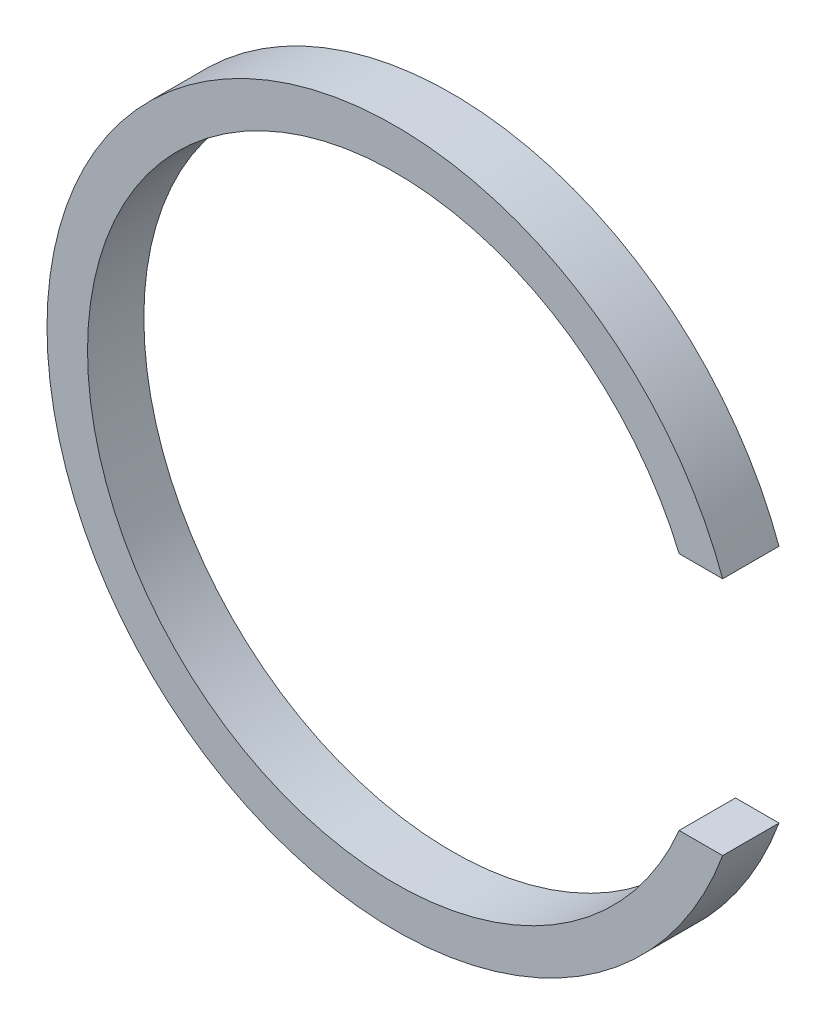
ISO-10303-21;
HEADER;
FILE_DESCRIPTION(('STEP AP214'),'2;1');
FILE_NAME('part.step','',(''),(''),'','','');
FILE_SCHEMA(('AUTOMOTIVE_DESIGN { 1 0 10303 214 1 1 1 1 }'));
ENDSEC;
DATA;
#1=APPLICATION_CONTEXT('core data for automotive mechanical design processes');
#2=APPLICATION_PROTOCOL_DEFINITION('international standard','automotive_design',2000,#1);
#3=PRODUCT_CONTEXT('',#1,'mechanical');
#4=PRODUCT('Part','Part','',(#3));
#5=PRODUCT_RELATED_PRODUCT_CATEGORY('part','',(#4));
#6=PRODUCT_DEFINITION_FORMATION('','',#4);
#7=PRODUCT_DEFINITION_CONTEXT('part definition',#1,'design');
#8=PRODUCT_DEFINITION('design','',#6,#7);
#9=PRODUCT_DEFINITION_SHAPE('','',#8);
#10=(LENGTH_UNIT() NAMED_UNIT(*) SI_UNIT(.MILLI.,.METRE.));
#11=(NAMED_UNIT(*) PLANE_ANGLE_UNIT() SI_UNIT($,.RADIAN.));
#12=(NAMED_UNIT(*) SI_UNIT($,.STERADIAN.) SOLID_ANGLE_UNIT());
#13=UNCERTAINTY_MEASURE_WITH_UNIT(LENGTH_MEASURE(1.E-05),#10,'distance_accuracy_value','');
#14=(GEOMETRIC_REPRESENTATION_CONTEXT(3) GLOBAL_UNCERTAINTY_ASSIGNED_CONTEXT((#13)) GLOBAL_UNIT_ASSIGNED_CONTEXT((#10,
#11,#12)) REPRESENTATION_CONTEXT('',''));
#15=CARTESIAN_POINT('',(0.,0.,0.));
#16=DIRECTION('',(0.,0.,1.));
#17=DIRECTION('',(1.,0.,0.));
#18=AXIS2_PLACEMENT_3D('',#15,#16,#17);
#19=CARTESIAN_POINT('',(70.009432937654,29.574977595057,13.9));
#20=DIRECTION('',(0.,1.,0.));
#21=DIRECTION('',(0.,0.,1.));
#22=AXIS2_PLACEMENT_3D('',#19,#20,#21);
#23=PLANE('',#22);
#24=DIRECTION('',(1.,0.,0.));
#25=VECTOR('',#24,1.);
#26=CARTESIAN_POINT('',(70.009432937654,29.574977595057,0.));
#27=LINE('',#26,#25);
#28=CARTESIAN_POINT('',(70.009432937654,29.574977595057,0.));
#29=VERTEX_POINT('',#28);
#30=CARTESIAN_POINT('',(80.7546946019355,29.574977595057,0.));
#31=VERTEX_POINT('',#30);
#32=EDGE_CURVE('E98',#29,#31,#27,.T.);
#33=ORIENTED_EDGE('',*,*,#32,.T.);
#34=DIRECTION('',(0.,0.,-1.));
#35=VECTOR('',#34,1.);
#36=CARTESIAN_POINT('',(80.7546946019355,29.574977595057,13.9));
#37=LINE('',#36,#35);
#38=CARTESIAN_POINT('',(80.7546946019355,29.574977595057,13.9));
#39=VERTEX_POINT('',#38);
#40=EDGE_CURVE('E11',#39,#31,#37,.T.);
#41=ORIENTED_EDGE('',*,*,#40,.F.);
#42=DIRECTION('',(1.,0.,0.));
#43=VECTOR('',#42,1.);
#44=CARTESIAN_POINT('',(70.009432937654,29.574977595057,13.9));
#45=LINE('',#44,#43);
#46=CARTESIAN_POINT('',(70.009432937654,29.574977595057,13.9));
#47=VERTEX_POINT('',#46);
#48=EDGE_CURVE('E84',#47,#39,#45,.T.);
#49=ORIENTED_EDGE('',*,*,#48,.F.);
#50=DIRECTION('',(0.,0.,-1.));
#51=VECTOR('',#50,1.);
#52=CARTESIAN_POINT('',(70.009432937654,29.574977595057,13.9));
#53=LINE('',#52,#51);
#54=EDGE_CURVE('E51',#47,#29,#53,.T.);
#55=ORIENTED_EDGE('',*,*,#54,.T.);
#56=EDGE_LOOP('',(#33,#41,#49,#55));
#57=FACE_BOUND('',#56,.T.);
#58=ADVANCED_FACE('F35',(#57),#23,.F.);
#59=CARTESIAN_POINT('',(0.,0.,13.9));
#60=DIRECTION('',(0.,0.,-1.));
#61=DIRECTION('',(-1.,0.,0.));
#62=AXIS2_PLACEMENT_3D('',#59,#60,#61);
#63=CYLINDRICAL_SURFACE('',#62,86.);
#64=CARTESIAN_POINT('',(0.,0.,0.));
#65=DIRECTION('',(0.,0.,1.));
#66=DIRECTION('',(1.,0.,0.));
#67=AXIS2_PLACEMENT_3D('',#64,#65,#66);
#68=CIRCLE('',#67,86.);
#69=CARTESIAN_POINT('',(80.7546578611195,-29.5750779159334,0.));
#70=VERTEX_POINT('',#69);
#71=EDGE_CURVE('E89',#31,#70,#68,.T.);
#72=ORIENTED_EDGE('',*,*,#71,.T.);
#73=DIRECTION('',(0.,0.,-1.));
#74=VECTOR('',#73,1.);
#75=CARTESIAN_POINT('',(80.7546578611195,-29.5750779159334,13.9));
#76=LINE('',#75,#74);
#77=CARTESIAN_POINT('',(80.7546578611195,-29.5750779159334,13.9));
#78=VERTEX_POINT('',#77);
#79=EDGE_CURVE('E43',#78,#70,#76,.T.);
#80=ORIENTED_EDGE('',*,*,#79,.F.);
#81=CARTESIAN_POINT('',(0.,0.,13.9));
#82=DIRECTION('',(0.,0.,1.));
#83=DIRECTION('',(1.,0.,0.));
#84=AXIS2_PLACEMENT_3D('',#81,#82,#83);
#85=CIRCLE('',#84,86.);
#86=EDGE_CURVE('E76',#39,#78,#85,.T.);
#87=ORIENTED_EDGE('',*,*,#86,.F.);
#88=ORIENTED_EDGE('',*,*,#40,.T.);
#89=EDGE_LOOP('',(#72,#80,#87,#88));
#90=FACE_BOUND('',#89,.T.);
#91=ADVANCED_FACE('F88',(#90),#63,.T.);
#92=CARTESIAN_POINT('',(70.0093905577421,-29.5750779159334,13.9));
#93=DIRECTION('',(0.,1.,0.));
#94=DIRECTION('',(0.,0.,1.));
#95=AXIS2_PLACEMENT_3D('',#92,#93,#94);
#96=PLANE('',#95);
#97=DIRECTION('',(1.,0.,0.));
#98=VECTOR('',#97,1.);
#99=CARTESIAN_POINT('',(70.0093905577421,-29.5750779159334,0.));
#100=LINE('',#99,#98);
#101=CARTESIAN_POINT('',(70.0093905577421,-29.5750779159334,0.));
#102=VERTEX_POINT('',#101);
#103=EDGE_CURVE('E101',#102,#70,#100,.T.);
#104=ORIENTED_EDGE('',*,*,#103,.F.);
#105=DIRECTION('',(0.,0.,-1.));
#106=VECTOR('',#105,1.);
#107=CARTESIAN_POINT('',(70.0093905577421,-29.5750779159334,13.9));
#108=LINE('',#107,#106);
#109=CARTESIAN_POINT('',(70.0093905577421,-29.5750779159334,13.9));
#110=VERTEX_POINT('',#109);
#111=EDGE_CURVE('E65',#110,#102,#108,.T.);
#112=ORIENTED_EDGE('',*,*,#111,.F.);
#113=DIRECTION('',(1.,0.,0.));
#114=VECTOR('',#113,1.);
#115=CARTESIAN_POINT('',(70.0093905577421,-29.5750779159334,13.9));
#116=LINE('',#115,#114);
#117=EDGE_CURVE('E83',#110,#78,#116,.T.);
#118=ORIENTED_EDGE('',*,*,#117,.T.);
#119=ORIENTED_EDGE('',*,*,#79,.T.);
#120=EDGE_LOOP('',(#104,#112,#118,#119));
#121=FACE_BOUND('',#120,.T.);
#122=ADVANCED_FACE('F92',(#121),#96,.T.);
#123=CARTESIAN_POINT('',(0.,0.,13.9));
#124=DIRECTION('',(0.,0.,-1.));
#125=DIRECTION('',(-1.,0.,0.));
#126=AXIS2_PLACEMENT_3D('',#123,#124,#125);
#127=CYLINDRICAL_SURFACE('',#126,76.);
#128=CARTESIAN_POINT('',(0.,0.,0.));
#129=DIRECTION('',(0.,0.,1.));
#130=DIRECTION('',(1.,0.,0.));
#131=AXIS2_PLACEMENT_3D('',#128,#129,#130);
#132=CIRCLE('',#131,76.);
#133=EDGE_CURVE('E103',#29,#102,#132,.T.);
#134=ORIENTED_EDGE('',*,*,#133,.F.);
#135=ORIENTED_EDGE('',*,*,#54,.F.);
#136=CARTESIAN_POINT('',(0.,0.,13.9));
#137=DIRECTION('',(0.,0.,1.));
#138=DIRECTION('',(1.,0.,0.));
#139=AXIS2_PLACEMENT_3D('',#136,#137,#138);
#140=CIRCLE('',#139,76.);
#141=EDGE_CURVE('E93',#47,#110,#140,.T.);
#142=ORIENTED_EDGE('',*,*,#141,.T.);
#143=ORIENTED_EDGE('',*,*,#111,.T.);
#144=EDGE_LOOP('',(#134,#135,#142,#143));
#145=FACE_BOUND('',#144,.T.);
#146=ADVANCED_FACE('F109',(#145),#127,.F.);
#147=CARTESIAN_POINT('',(0.,0.,13.9));
#148=DIRECTION('',(0.,0.,1.));
#149=DIRECTION('',(1.,0.,0.));
#150=AXIS2_PLACEMENT_3D('',#147,#148,#149);
#151=PLANE('',#150);
#152=ORIENTED_EDGE('',*,*,#48,.T.);
#153=ORIENTED_EDGE('',*,*,#86,.T.);
#154=ORIENTED_EDGE('',*,*,#117,.F.);
#155=ORIENTED_EDGE('',*,*,#141,.F.);
#156=EDGE_LOOP('',(#152,#153,#154,#155));
#157=FACE_BOUND('',#156,.T.);
#158=ADVANCED_FACE('F80',(#157),#151,.T.);
#159=CARTESIAN_POINT('',(0.,0.,0.));
#160=DIRECTION('',(0.,0.,1.));
#161=DIRECTION('',(1.,0.,0.));
#162=AXIS2_PLACEMENT_3D('',#159,#160,#161);
#163=PLANE('',#162);
#164=ORIENTED_EDGE('',*,*,#32,.F.);
#165=ORIENTED_EDGE('',*,*,#133,.T.);
#166=ORIENTED_EDGE('',*,*,#103,.T.);
#167=ORIENTED_EDGE('',*,*,#71,.F.);
#168=EDGE_LOOP('',(#164,#165,#166,#167));
#169=FACE_BOUND('',#168,.T.);
#170=ADVANCED_FACE('F108',(#169),#163,.F.);
#171=CLOSED_SHELL('',(#58,#91,#122,#146,#158,#170));
#172=MANIFOLD_SOLID_BREP('B2',#171);
#173=ADVANCED_BREP_SHAPE_REPRESENTATION('',(#18,#172),#14);
#174=SHAPE_DEFINITION_REPRESENTATION(#9,#173);
ENDSEC;
END-ISO-10303-21;
